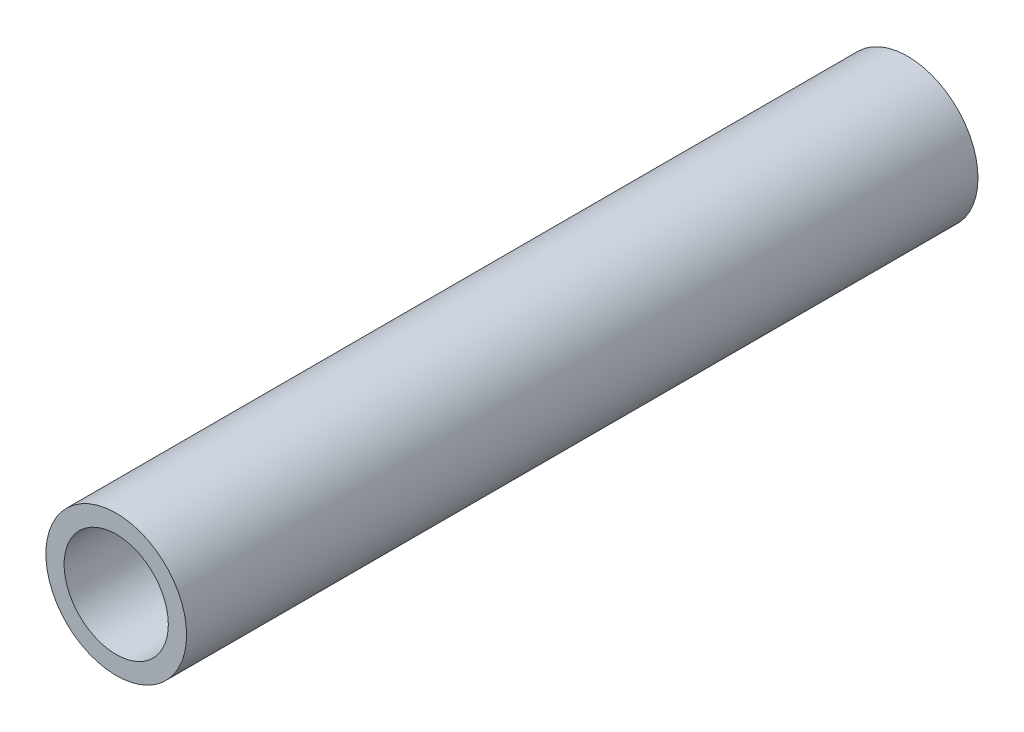
ISO-10303-21;
HEADER;
FILE_DESCRIPTION(('STEP AP214'),'2;1');
FILE_NAME('part.step','',(''),(''),'','','');
FILE_SCHEMA(('AUTOMOTIVE_DESIGN { 1 0 10303 214 1 1 1 1 }'));
ENDSEC;
DATA;
#1=APPLICATION_CONTEXT('core data for automotive mechanical design processes');
#2=APPLICATION_PROTOCOL_DEFINITION('international standard','automotive_design',2000,#1);
#3=PRODUCT_CONTEXT('',#1,'mechanical');
#4=PRODUCT('Part','Part','',(#3));
#5=PRODUCT_RELATED_PRODUCT_CATEGORY('part','',(#4));
#6=PRODUCT_DEFINITION_FORMATION('','',#4);
#7=PRODUCT_DEFINITION_CONTEXT('part definition',#1,'design');
#8=PRODUCT_DEFINITION('design','',#6,#7);
#9=PRODUCT_DEFINITION_SHAPE('','',#8);
#10=(LENGTH_UNIT() NAMED_UNIT(*) SI_UNIT(.MILLI.,.METRE.));
#11=(NAMED_UNIT(*) PLANE_ANGLE_UNIT() SI_UNIT($,.RADIAN.));
#12=(NAMED_UNIT(*) SI_UNIT($,.STERADIAN.) SOLID_ANGLE_UNIT());
#13=UNCERTAINTY_MEASURE_WITH_UNIT(LENGTH_MEASURE(1.E-05),#10,'distance_accuracy_value','');
#14=(GEOMETRIC_REPRESENTATION_CONTEXT(3) GLOBAL_UNCERTAINTY_ASSIGNED_CONTEXT((#13)) GLOBAL_UNIT_ASSIGNED_CONTEXT((#10,
#11,#12)) REPRESENTATION_CONTEXT('',''));
#15=CARTESIAN_POINT('',(0.,0.,0.));
#16=DIRECTION('',(0.,0.,1.));
#17=DIRECTION('',(1.,0.,0.));
#18=AXIS2_PLACEMENT_3D('',#15,#16,#17);
#19=CARTESIAN_POINT('',(0.,0.,60.));
#20=DIRECTION('',(0.,0.,1.));
#21=DIRECTION('',(1.,0.,0.));
#22=AXIS2_PLACEMENT_3D('',#19,#20,#21);
#23=PLANE('',#22);
#24=CARTESIAN_POINT('',(0.,0.,60.));
#25=DIRECTION('',(0.,0.,1.));
#26=DIRECTION('',(1.,0.,0.));
#27=AXIS2_PLACEMENT_3D('',#24,#25,#26);
#28=CIRCLE('',#27,10.668);
#29=CARTESIAN_POINT('',(10.668,0.,60.));
#30=VERTEX_POINT('',#29);
#31=EDGE_CURVE('E11',#30,#30,#28,.T.);
#32=ORIENTED_EDGE('',*,*,#31,.T.);
#33=EDGE_LOOP('',(#32));
#34=FACE_BOUND('',#33,.T.);
#35=CARTESIAN_POINT('',(0.,0.,60.));
#36=DIRECTION('',(0.,0.,1.));
#37=DIRECTION('',(1.,0.,0.));
#38=AXIS2_PLACEMENT_3D('',#35,#36,#37);
#39=CIRCLE('',#38,7.8994);
#40=CARTESIAN_POINT('',(7.8994,0.,60.));
#41=VERTEX_POINT('',#40);
#42=EDGE_CURVE('E48',#41,#41,#39,.T.);
#43=ORIENTED_EDGE('',*,*,#42,.F.);
#44=EDGE_LOOP('',(#43));
#45=FACE_BOUND('',#44,.T.);
#46=ADVANCED_FACE('F37',(#34,#45),#23,.T.);
#47=CARTESIAN_POINT('',(0.,0.,-60.));
#48=DIRECTION('',(0.,0.,1.));
#49=DIRECTION('',(1.,0.,0.));
#50=AXIS2_PLACEMENT_3D('',#47,#48,#49);
#51=PLANE('',#50);
#52=CARTESIAN_POINT('',(0.,0.,-60.));
#53=DIRECTION('',(0.,0.,1.));
#54=DIRECTION('',(1.,0.,0.));
#55=AXIS2_PLACEMENT_3D('',#52,#53,#54);
#56=CIRCLE('',#55,10.668);
#57=CARTESIAN_POINT('',(10.668,0.,-60.));
#58=VERTEX_POINT('',#57);
#59=EDGE_CURVE('E41',#58,#58,#56,.T.);
#60=ORIENTED_EDGE('',*,*,#59,.F.);
#61=EDGE_LOOP('',(#60));
#62=FACE_BOUND('',#61,.T.);
#63=CARTESIAN_POINT('',(0.,0.,-60.));
#64=DIRECTION('',(0.,0.,1.));
#65=DIRECTION('',(1.,0.,0.));
#66=AXIS2_PLACEMENT_3D('',#63,#64,#65);
#67=CIRCLE('',#66,7.8994);
#68=CARTESIAN_POINT('',(7.8994,0.,-60.));
#69=VERTEX_POINT('',#68);
#70=EDGE_CURVE('E50',#69,#69,#67,.T.);
#71=ORIENTED_EDGE('',*,*,#70,.T.);
#72=EDGE_LOOP('',(#71));
#73=FACE_BOUND('',#72,.T.);
#74=ADVANCED_FACE('F60',(#62,#73),#51,.F.);
#75=CARTESIAN_POINT('',(0.,0.,60.));
#76=DIRECTION('',(0.,0.,-1.));
#77=DIRECTION('',(-1.,0.,0.));
#78=AXIS2_PLACEMENT_3D('',#75,#76,#77);
#79=CYLINDRICAL_SURFACE('',#78,10.668);
#80=ORIENTED_EDGE('',*,*,#31,.F.);
#81=EDGE_LOOP('',(#80));
#82=FACE_BOUND('',#81,.T.);
#83=ORIENTED_EDGE('',*,*,#59,.T.);
#84=EDGE_LOOP('',(#83));
#85=FACE_BOUND('',#84,.T.);
#86=ADVANCED_FACE('F39',(#82,#85),#79,.T.);
#87=CARTESIAN_POINT('',(0.,0.,60.));
#88=DIRECTION('',(0.,0.,-1.));
#89=DIRECTION('',(-1.,0.,0.));
#90=AXIS2_PLACEMENT_3D('',#87,#88,#89);
#91=CYLINDRICAL_SURFACE('',#90,7.8994);
#92=ORIENTED_EDGE('',*,*,#42,.T.);
#93=EDGE_LOOP('',(#92));
#94=FACE_BOUND('',#93,.T.);
#95=ORIENTED_EDGE('',*,*,#70,.F.);
#96=EDGE_LOOP('',(#95));
#97=FACE_BOUND('',#96,.T.);
#98=ADVANCED_FACE('F56',(#94,#97),#91,.F.);
#99=CLOSED_SHELL('',(#46,#74,#86,#98));
#100=MANIFOLD_SOLID_BREP('B2',#99);
#101=ADVANCED_BREP_SHAPE_REPRESENTATION('',(#18,#100),#14);
#102=SHAPE_DEFINITION_REPRESENTATION(#9,#101);
ENDSEC;
END-ISO-10303-21;
